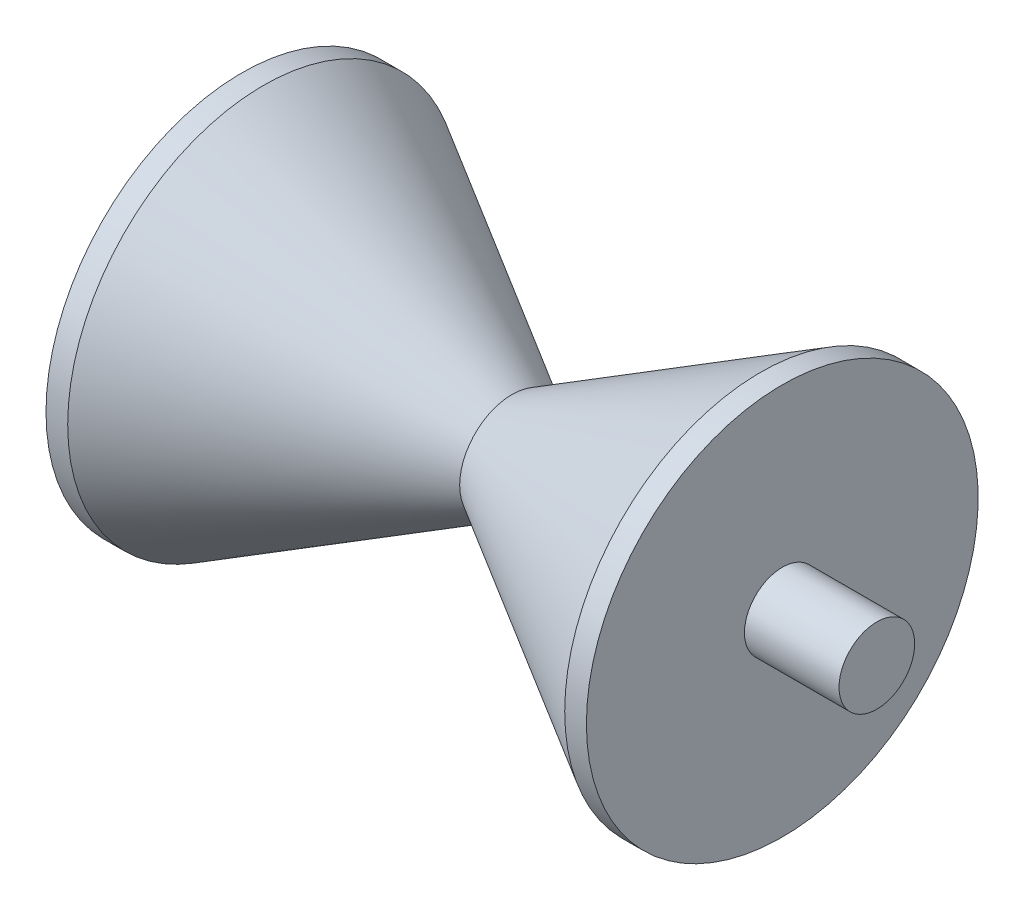
ISO-10303-21;
HEADER;
FILE_DESCRIPTION(('STEP AP214'),'2;1');
FILE_NAME('part.step','',(''),(''),'','','');
FILE_SCHEMA(('AUTOMOTIVE_DESIGN { 1 0 10303 214 1 1 1 1 }'));
ENDSEC;
DATA;
#1=APPLICATION_CONTEXT('core data for automotive mechanical design processes');
#2=APPLICATION_PROTOCOL_DEFINITION('international standard','automotive_design',2000,#1);
#3=PRODUCT_CONTEXT('',#1,'mechanical');
#4=PRODUCT('Part','Part','',(#3));
#5=PRODUCT_RELATED_PRODUCT_CATEGORY('part','',(#4));
#6=PRODUCT_DEFINITION_FORMATION('','',#4);
#7=PRODUCT_DEFINITION_CONTEXT('part definition',#1,'design');
#8=PRODUCT_DEFINITION('design','',#6,#7);
#9=PRODUCT_DEFINITION_SHAPE('','',#8);
#10=(LENGTH_UNIT() NAMED_UNIT(*) SI_UNIT(.MILLI.,.METRE.));
#11=(NAMED_UNIT(*) PLANE_ANGLE_UNIT() SI_UNIT($,.RADIAN.));
#12=(NAMED_UNIT(*) SI_UNIT($,.STERADIAN.) SOLID_ANGLE_UNIT());
#13=UNCERTAINTY_MEASURE_WITH_UNIT(LENGTH_MEASURE(1.E-05),#10,'distance_accuracy_value','');
#14=(GEOMETRIC_REPRESENTATION_CONTEXT(3) GLOBAL_UNCERTAINTY_ASSIGNED_CONTEXT((#13)) GLOBAL_UNIT_ASSIGNED_CONTEXT((#10,
#11,#12)) REPRESENTATION_CONTEXT('',''));
#15=CARTESIAN_POINT('',(0.,0.,0.));
#16=DIRECTION('',(0.,0.,1.));
#17=DIRECTION('',(1.,0.,0.));
#18=AXIS2_PLACEMENT_3D('',#15,#16,#17);
#19=CARTESIAN_POINT('',(1.75,0.7,0.));
#20=DIRECTION('',(1.,0.,0.));
#21=DIRECTION('',(0.,0.,-1.));
#22=AXIS2_PLACEMENT_3D('',#19,#20,#21);
#23=PLANE('',#22);
#24=CARTESIAN_POINT('',(1.75,0.,0.));
#25=DIRECTION('',(-1.,0.,0.));
#26=DIRECTION('',(0.,0.,1.));
#27=AXIS2_PLACEMENT_3D('',#24,#25,#26);
#28=CIRCLE('',#27,0.7);
#29=CARTESIAN_POINT('',(1.75,0.,0.7));
#30=VERTEX_POINT('',#29);
#31=EDGE_CURVE('E66',#30,#30,#28,.T.);
#32=ORIENTED_EDGE('',*,*,#31,.F.);
#33=EDGE_LOOP('',(#32));
#34=FACE_BOUND('',#33,.T.);
#35=CARTESIAN_POINT('',(1.75,0.,0.));
#36=DIRECTION('',(-1.,0.,0.));
#37=DIRECTION('',(0.,0.,1.));
#38=AXIS2_PLACEMENT_3D('',#35,#36,#37);
#39=CIRCLE('',#38,3.625);
#40=CARTESIAN_POINT('',(1.75,0.,3.625));
#41=VERTEX_POINT('',#40);
#42=EDGE_CURVE('E10',#41,#41,#39,.T.);
#43=ORIENTED_EDGE('',*,*,#42,.T.);
#44=EDGE_LOOP('',(#43));
#45=FACE_BOUND('',#44,.T.);
#46=ADVANCED_FACE('F35',(#34,#45),#23,.F.);
#47=CARTESIAN_POINT('',(0.,0.,0.));
#48=DIRECTION('',(-1.,0.,0.));
#49=DIRECTION('',(0.,0.,1.));
#50=AXIS2_PLACEMENT_3D('',#47,#48,#49);
#51=CYLINDRICAL_SURFACE('',#50,3.625);
#52=ORIENTED_EDGE('',*,*,#42,.F.);
#53=EDGE_LOOP('',(#52));
#54=FACE_BOUND('',#53,.T.);
#55=CARTESIAN_POINT('',(2.15140510590468,0.,0.));
#56=DIRECTION('',(-1.,0.,0.));
#57=DIRECTION('',(0.,0.,1.));
#58=AXIS2_PLACEMENT_3D('',#55,#56,#57);
#59=CIRCLE('',#58,3.625);
#60=CARTESIAN_POINT('',(2.15140510590468,0.,3.625));
#61=VERTEX_POINT('',#60);
#62=EDGE_CURVE('E41',#61,#61,#59,.T.);
#63=ORIENTED_EDGE('',*,*,#62,.T.);
#64=EDGE_LOOP('',(#63));
#65=FACE_BOUND('',#64,.T.);
#66=ADVANCED_FACE('F73',(#54,#65),#51,.T.);
#67=CARTESIAN_POINT('',(6.75,0.,0.));
#68=DIRECTION('',(-1.,0.,0.));
#69=DIRECTION('',(0.,0.,1.));
#70=AXIS2_PLACEMENT_3D('',#67,#68,#69);
#71=CONICAL_SURFACE('',#70,0.97,0.523598775598304);
#72=ORIENTED_EDGE('',*,*,#62,.F.);
#73=EDGE_LOOP('',(#72));
#74=FACE_BOUND('',#73,.T.);
#75=CARTESIAN_POINT('',(6.75,0.,0.));
#76=DIRECTION('',(-1.,0.,0.));
#77=DIRECTION('',(0.,0.,1.));
#78=AXIS2_PLACEMENT_3D('',#75,#76,#77);
#79=CIRCLE('',#78,0.97);
#80=CARTESIAN_POINT('',(6.75,0.,0.97));
#81=VERTEX_POINT('',#80);
#82=EDGE_CURVE('E45',#81,#81,#79,.T.);
#83=ORIENTED_EDGE('',*,*,#82,.T.);
#84=EDGE_LOOP('',(#83));
#85=FACE_BOUND('',#84,.T.);
#86=ADVANCED_FACE('F77',(#74,#85),#71,.T.);
#87=CARTESIAN_POINT('',(11.3485948940953,0.,0.));
#88=DIRECTION('',(1.,0.,0.));
#89=DIRECTION('',(0.,0.,-1.));
#90=AXIS2_PLACEMENT_3D('',#87,#88,#89);
#91=CONICAL_SURFACE('',#90,3.625,0.523598775598303);
#92=ORIENTED_EDGE('',*,*,#82,.F.);
#93=EDGE_LOOP('',(#92));
#94=FACE_BOUND('',#93,.T.);
#95=CARTESIAN_POINT('',(11.3485948940953,0.,0.));
#96=DIRECTION('',(-1.,0.,0.));
#97=DIRECTION('',(0.,0.,1.));
#98=AXIS2_PLACEMENT_3D('',#95,#96,#97);
#99=CIRCLE('',#98,3.625);
#100=CARTESIAN_POINT('',(11.3485948940953,0.,3.625));
#101=VERTEX_POINT('',#100);
#102=EDGE_CURVE('E49',#101,#101,#99,.T.);
#103=ORIENTED_EDGE('',*,*,#102,.T.);
#104=EDGE_LOOP('',(#103));
#105=FACE_BOUND('',#104,.T.);
#106=ADVANCED_FACE('F82',(#94,#105),#91,.T.);
#107=CARTESIAN_POINT('',(0.,0.,0.));
#108=DIRECTION('',(-1.,0.,0.));
#109=DIRECTION('',(0.,0.,1.));
#110=AXIS2_PLACEMENT_3D('',#107,#108,#109);
#111=CYLINDRICAL_SURFACE('',#110,3.625);
#112=ORIENTED_EDGE('',*,*,#102,.F.);
#113=EDGE_LOOP('',(#112));
#114=FACE_BOUND('',#113,.T.);
#115=CARTESIAN_POINT('',(11.75,0.,0.));
#116=DIRECTION('',(-1.,0.,0.));
#117=DIRECTION('',(0.,0.,1.));
#118=AXIS2_PLACEMENT_3D('',#115,#116,#117);
#119=CIRCLE('',#118,3.625);
#120=CARTESIAN_POINT('',(11.75,0.,3.625));
#121=VERTEX_POINT('',#120);
#122=EDGE_CURVE('E54',#121,#121,#119,.T.);
#123=ORIENTED_EDGE('',*,*,#122,.T.);
#124=EDGE_LOOP('',(#123));
#125=FACE_BOUND('',#124,.T.);
#126=ADVANCED_FACE('F88',(#114,#125),#111,.T.);
#127=CARTESIAN_POINT('',(11.75,3.625,0.));
#128=DIRECTION('',(-1.,0.,0.));
#129=DIRECTION('',(0.,0.,1.));
#130=AXIS2_PLACEMENT_3D('',#127,#128,#129);
#131=PLANE('',#130);
#132=ORIENTED_EDGE('',*,*,#122,.F.);
#133=EDGE_LOOP('',(#132));
#134=FACE_BOUND('',#133,.T.);
#135=CARTESIAN_POINT('',(11.75,0.,0.));
#136=DIRECTION('',(-1.,0.,0.));
#137=DIRECTION('',(0.,0.,1.));
#138=AXIS2_PLACEMENT_3D('',#135,#136,#137);
#139=CIRCLE('',#138,0.7);
#140=CARTESIAN_POINT('',(11.75,0.,0.7));
#141=VERTEX_POINT('',#140);
#142=EDGE_CURVE('E57',#141,#141,#139,.T.);
#143=ORIENTED_EDGE('',*,*,#142,.T.);
#144=EDGE_LOOP('',(#143));
#145=FACE_BOUND('',#144,.T.);
#146=ADVANCED_FACE('F92',(#134,#145),#131,.F.);
#147=CARTESIAN_POINT('',(0.,0.,0.));
#148=DIRECTION('',(-1.,0.,0.));
#149=DIRECTION('',(0.,0.,1.));
#150=AXIS2_PLACEMENT_3D('',#147,#148,#149);
#151=CYLINDRICAL_SURFACE('',#150,0.7);
#152=ORIENTED_EDGE('',*,*,#142,.F.);
#153=EDGE_LOOP('',(#152));
#154=FACE_BOUND('',#153,.T.);
#155=CARTESIAN_POINT('',(13.5,0.,0.));
#156=DIRECTION('',(-1.,0.,0.));
#157=DIRECTION('',(0.,0.,1.));
#158=AXIS2_PLACEMENT_3D('',#155,#156,#157);
#159=CIRCLE('',#158,0.7);
#160=CARTESIAN_POINT('',(13.5,0.,0.7));
#161=VERTEX_POINT('',#160);
#162=EDGE_CURVE('E60',#161,#161,#159,.T.);
#163=ORIENTED_EDGE('',*,*,#162,.T.);
#164=EDGE_LOOP('',(#163));
#165=FACE_BOUND('',#164,.T.);
#166=ADVANCED_FACE('F96',(#154,#165),#151,.T.);
#167=CARTESIAN_POINT('',(13.5,0.7,0.));
#168=DIRECTION('',(-1.,0.,0.));
#169=DIRECTION('',(0.,0.,1.));
#170=AXIS2_PLACEMENT_3D('',#167,#168,#169);
#171=PLANE('',#170);
#172=ORIENTED_EDGE('',*,*,#162,.F.);
#173=EDGE_LOOP('',(#172));
#174=FACE_BOUND('',#173,.T.);
#175=ADVANCED_FACE('F100',(#174),#171,.F.);
#176=CARTESIAN_POINT('',(0.,0.,0.));
#177=DIRECTION('',(1.,0.,0.));
#178=DIRECTION('',(0.,0.,-1.));
#179=AXIS2_PLACEMENT_3D('',#176,#177,#178);
#180=PLANE('',#179);
#181=CARTESIAN_POINT('',(0.,0.,0.));
#182=DIRECTION('',(-1.,0.,0.));
#183=DIRECTION('',(0.,0.,1.));
#184=AXIS2_PLACEMENT_3D('',#181,#182,#183);
#185=CIRCLE('',#184,0.7);
#186=CARTESIAN_POINT('',(0.,0.,0.7));
#187=VERTEX_POINT('',#186);
#188=EDGE_CURVE('E63',#187,#187,#185,.T.);
#189=ORIENTED_EDGE('',*,*,#188,.T.);
#190=EDGE_LOOP('',(#189));
#191=FACE_BOUND('',#190,.T.);
#192=ADVANCED_FACE('F104',(#191),#180,.F.);
#193=CARTESIAN_POINT('',(0.,0.,0.));
#194=DIRECTION('',(-1.,0.,0.));
#195=DIRECTION('',(0.,0.,1.));
#196=AXIS2_PLACEMENT_3D('',#193,#194,#195);
#197=CYLINDRICAL_SURFACE('',#196,0.7);
#198=ORIENTED_EDGE('',*,*,#188,.F.);
#199=EDGE_LOOP('',(#198));
#200=FACE_BOUND('',#199,.T.);
#201=ORIENTED_EDGE('',*,*,#31,.T.);
#202=EDGE_LOOP('',(#201));
#203=FACE_BOUND('',#202,.T.);
#204=ADVANCED_FACE('F70',(#200,#203),#197,.T.);
#205=CLOSED_SHELL('',(#46,#66,#86,#106,#126,#146,#166,#175,#192,#204));
#206=MANIFOLD_SOLID_BREP('B2',#205);
#207=ADVANCED_BREP_SHAPE_REPRESENTATION('',(#18,#206),#14);
#208=SHAPE_DEFINITION_REPRESENTATION(#9,#207);
ENDSEC;
END-ISO-10303-21;
